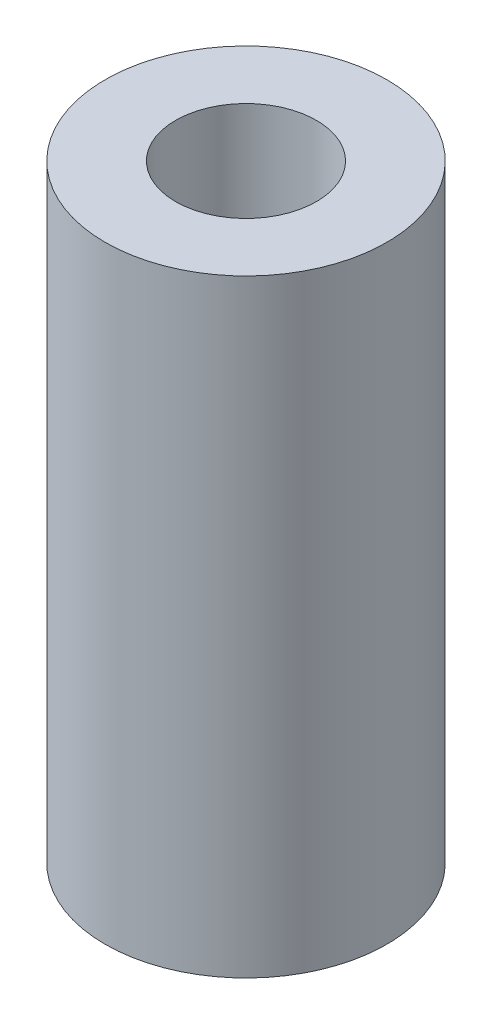
ISO-10303-21;
HEADER;
FILE_DESCRIPTION(('STEP AP214'),'2;1');
FILE_NAME('part.step','',(''),(''),'','','');
FILE_SCHEMA(('AUTOMOTIVE_DESIGN { 1 0 10303 214 1 1 1 1 }'));
ENDSEC;
DATA;
#1=APPLICATION_CONTEXT('core data for automotive mechanical design processes');
#2=APPLICATION_PROTOCOL_DEFINITION('international standard','automotive_design',2000,#1);
#3=PRODUCT_CONTEXT('',#1,'mechanical');
#4=PRODUCT('Part','Part','',(#3));
#5=PRODUCT_RELATED_PRODUCT_CATEGORY('part','',(#4));
#6=PRODUCT_DEFINITION_FORMATION('','',#4);
#7=PRODUCT_DEFINITION_CONTEXT('part definition',#1,'design');
#8=PRODUCT_DEFINITION('design','',#6,#7);
#9=PRODUCT_DEFINITION_SHAPE('','',#8);
#10=(LENGTH_UNIT() NAMED_UNIT(*) SI_UNIT(.MILLI.,.METRE.));
#11=(NAMED_UNIT(*) PLANE_ANGLE_UNIT() SI_UNIT($,.RADIAN.));
#12=(NAMED_UNIT(*) SI_UNIT($,.STERADIAN.) SOLID_ANGLE_UNIT());
#13=UNCERTAINTY_MEASURE_WITH_UNIT(LENGTH_MEASURE(1.E-05),#10,'distance_accuracy_value','');
#14=(GEOMETRIC_REPRESENTATION_CONTEXT(3) GLOBAL_UNCERTAINTY_ASSIGNED_CONTEXT((#13)) GLOBAL_UNIT_ASSIGNED_CONTEXT((#10,
#11,#12)) REPRESENTATION_CONTEXT('',''));
#15=CARTESIAN_POINT('',(0.,0.,0.));
#16=DIRECTION('',(0.,0.,1.));
#17=DIRECTION('',(1.,0.,0.));
#18=AXIS2_PLACEMENT_3D('',#15,#16,#17);
#19=CARTESIAN_POINT('',(0.,6.474,0.));
#20=DIRECTION('',(0.,1.,0.));
#21=DIRECTION('',(0.,0.,1.));
#22=AXIS2_PLACEMENT_3D('',#19,#20,#21);
#23=PLANE('',#22);
#24=CARTESIAN_POINT('',(0.,6.474,0.));
#25=DIRECTION('',(0.,1.,0.));
#26=DIRECTION('',(0.,0.,1.));
#27=AXIS2_PLACEMENT_3D('',#24,#25,#26);
#28=CIRCLE('',#27,3.);
#29=CARTESIAN_POINT('',(0.,6.474,3.));
#30=VERTEX_POINT('',#29);
#31=EDGE_CURVE('E10',#30,#30,#28,.T.);
#32=ORIENTED_EDGE('',*,*,#31,.T.);
#33=EDGE_LOOP('',(#32));
#34=FACE_BOUND('',#33,.T.);
#35=CARTESIAN_POINT('',(0.,6.474,0.));
#36=DIRECTION('',(0.,1.,0.));
#37=DIRECTION('',(0.,0.,1.));
#38=AXIS2_PLACEMENT_3D('',#35,#36,#37);
#39=CIRCLE('',#38,1.5);
#40=CARTESIAN_POINT('',(0.,6.474,1.5));
#41=VERTEX_POINT('',#40);
#42=EDGE_CURVE('E48',#41,#41,#39,.T.);
#43=ORIENTED_EDGE('',*,*,#42,.F.);
#44=EDGE_LOOP('',(#43));
#45=FACE_BOUND('',#44,.T.);
#46=ADVANCED_FACE('F37',(#34,#45),#23,.T.);
#47=CARTESIAN_POINT('',(0.,-6.474,0.));
#48=DIRECTION('',(0.,1.,0.));
#49=DIRECTION('',(0.,0.,1.));
#50=AXIS2_PLACEMENT_3D('',#47,#48,#49);
#51=PLANE('',#50);
#52=CARTESIAN_POINT('',(0.,-6.474,0.));
#53=DIRECTION('',(0.,1.,0.));
#54=DIRECTION('',(0.,0.,1.));
#55=AXIS2_PLACEMENT_3D('',#52,#53,#54);
#56=CIRCLE('',#55,3.);
#57=CARTESIAN_POINT('',(0.,-6.474,3.));
#58=VERTEX_POINT('',#57);
#59=EDGE_CURVE('E41',#58,#58,#56,.T.);
#60=ORIENTED_EDGE('',*,*,#59,.F.);
#61=EDGE_LOOP('',(#60));
#62=FACE_BOUND('',#61,.T.);
#63=CARTESIAN_POINT('',(0.,-6.474,0.));
#64=DIRECTION('',(0.,1.,0.));
#65=DIRECTION('',(0.,0.,1.));
#66=AXIS2_PLACEMENT_3D('',#63,#64,#65);
#67=CIRCLE('',#66,1.5);
#68=CARTESIAN_POINT('',(0.,-6.474,1.5));
#69=VERTEX_POINT('',#68);
#70=EDGE_CURVE('E50',#69,#69,#67,.T.);
#71=ORIENTED_EDGE('',*,*,#70,.T.);
#72=EDGE_LOOP('',(#71));
#73=FACE_BOUND('',#72,.T.);
#74=ADVANCED_FACE('F60',(#62,#73),#51,.F.);
#75=CARTESIAN_POINT('',(0.,6.474,0.));
#76=DIRECTION('',(0.,-1.,0.));
#77=DIRECTION('',(0.,0.,-1.));
#78=AXIS2_PLACEMENT_3D('',#75,#76,#77);
#79=CYLINDRICAL_SURFACE('',#78,3.);
#80=ORIENTED_EDGE('',*,*,#31,.F.);
#81=EDGE_LOOP('',(#80));
#82=FACE_BOUND('',#81,.T.);
#83=ORIENTED_EDGE('',*,*,#59,.T.);
#84=EDGE_LOOP('',(#83));
#85=FACE_BOUND('',#84,.T.);
#86=ADVANCED_FACE('F39',(#82,#85),#79,.T.);
#87=CARTESIAN_POINT('',(0.,6.474,0.));
#88=DIRECTION('',(0.,-1.,0.));
#89=DIRECTION('',(0.,0.,-1.));
#90=AXIS2_PLACEMENT_3D('',#87,#88,#89);
#91=CYLINDRICAL_SURFACE('',#90,1.5);
#92=ORIENTED_EDGE('',*,*,#42,.T.);
#93=EDGE_LOOP('',(#92));
#94=FACE_BOUND('',#93,.T.);
#95=ORIENTED_EDGE('',*,*,#70,.F.);
#96=EDGE_LOOP('',(#95));
#97=FACE_BOUND('',#96,.T.);
#98=ADVANCED_FACE('F56',(#94,#97),#91,.F.);
#99=CLOSED_SHELL('',(#46,#74,#86,#98));
#100=MANIFOLD_SOLID_BREP('B2',#99);
#101=ADVANCED_BREP_SHAPE_REPRESENTATION('',(#18,#100),#14);
#102=SHAPE_DEFINITION_REPRESENTATION(#9,#101);
ENDSEC;
END-ISO-10303-21;
